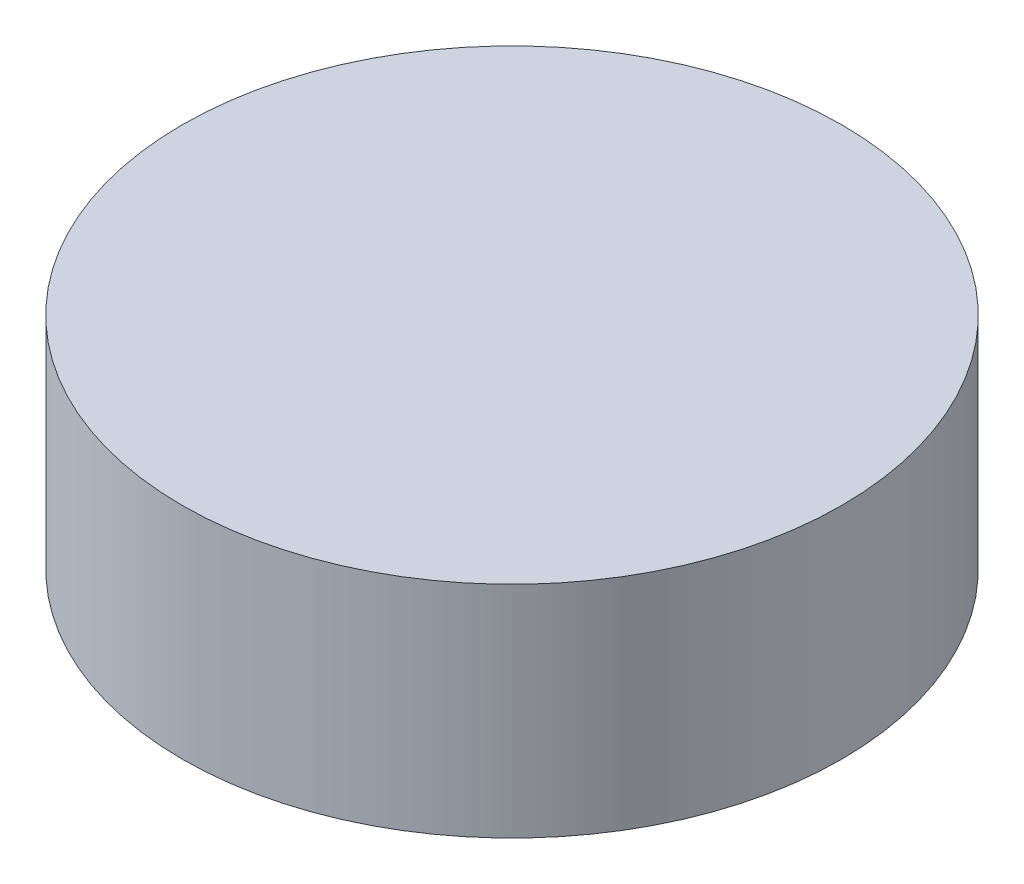
ISO-10303-21;
HEADER;
FILE_DESCRIPTION(('STEP AP214'),'2;1');
FILE_NAME('part.step','',(''),(''),'','','');
FILE_SCHEMA(('AUTOMOTIVE_DESIGN { 1 0 10303 214 1 1 1 1 }'));
ENDSEC;
DATA;
#1=APPLICATION_CONTEXT('core data for automotive mechanical design processes');
#2=APPLICATION_PROTOCOL_DEFINITION('international standard','automotive_design',2000,#1);
#3=PRODUCT_CONTEXT('',#1,'mechanical');
#4=PRODUCT('Part','Part','',(#3));
#5=PRODUCT_RELATED_PRODUCT_CATEGORY('part','',(#4));
#6=PRODUCT_DEFINITION_FORMATION('','',#4);
#7=PRODUCT_DEFINITION_CONTEXT('part definition',#1,'design');
#8=PRODUCT_DEFINITION('design','',#6,#7);
#9=PRODUCT_DEFINITION_SHAPE('','',#8);
#10=(LENGTH_UNIT() NAMED_UNIT(*) SI_UNIT(.MILLI.,.METRE.));
#11=(NAMED_UNIT(*) PLANE_ANGLE_UNIT() SI_UNIT($,.RADIAN.));
#12=(NAMED_UNIT(*) SI_UNIT($,.STERADIAN.) SOLID_ANGLE_UNIT());
#13=UNCERTAINTY_MEASURE_WITH_UNIT(LENGTH_MEASURE(1.E-05),#10,'distance_accuracy_value','');
#14=(GEOMETRIC_REPRESENTATION_CONTEXT(3) GLOBAL_UNCERTAINTY_ASSIGNED_CONTEXT((#13)) GLOBAL_UNIT_ASSIGNED_CONTEXT((#10,
#11,#12)) REPRESENTATION_CONTEXT('',''));
#15=CARTESIAN_POINT('',(0.,0.,0.));
#16=DIRECTION('',(0.,0.,1.));
#17=DIRECTION('',(1.,0.,0.));
#18=AXIS2_PLACEMENT_3D('',#15,#16,#17);
#19=CARTESIAN_POINT('',(0.,10.,0.));
#20=DIRECTION('',(0.,-1.,0.));
#21=DIRECTION('',(0.,0.,-1.));
#22=AXIS2_PLACEMENT_3D('',#19,#20,#21);
#23=CYLINDRICAL_SURFACE('',#22,15.);
#24=CARTESIAN_POINT('',(0.,10.,0.));
#25=DIRECTION('',(0.,1.,0.));
#26=DIRECTION('',(0.,0.,1.));
#27=AXIS2_PLACEMENT_3D('',#24,#25,#26);
#28=CIRCLE('',#27,15.);
#29=CARTESIAN_POINT('',(0.,10.,15.));
#30=VERTEX_POINT('',#29);
#31=EDGE_CURVE('E43',#30,#30,#28,.T.);
#32=ORIENTED_EDGE('',*,*,#31,.F.);
#33=EDGE_LOOP('',(#32));
#34=FACE_BOUND('',#33,.T.);
#35=CARTESIAN_POINT('',(0.,0.,0.));
#36=DIRECTION('',(0.,1.,0.));
#37=DIRECTION('',(0.,0.,1.));
#38=AXIS2_PLACEMENT_3D('',#35,#36,#37);
#39=CIRCLE('',#38,15.);
#40=CARTESIAN_POINT('',(0.,0.,15.));
#41=VERTEX_POINT('',#40);
#42=EDGE_CURVE('E38',#41,#41,#39,.T.);
#43=ORIENTED_EDGE('',*,*,#42,.T.);
#44=EDGE_LOOP('',(#43));
#45=FACE_BOUND('',#44,.T.);
#46=ADVANCED_FACE('F35',(#34,#45),#23,.T.);
#47=CARTESIAN_POINT('',(0.,10.,0.));
#48=DIRECTION('',(0.,1.,0.));
#49=DIRECTION('',(0.,0.,1.));
#50=AXIS2_PLACEMENT_3D('',#47,#48,#49);
#51=PLANE('',#50);
#52=ORIENTED_EDGE('',*,*,#31,.T.);
#53=EDGE_LOOP('',(#52));
#54=FACE_BOUND('',#53,.T.);
#55=ADVANCED_FACE('F63',(#54),#51,.T.);
#56=CARTESIAN_POINT('',(0.,0.,0.));
#57=DIRECTION('',(0.,1.,0.));
#58=DIRECTION('',(0.,0.,1.));
#59=AXIS2_PLACEMENT_3D('',#56,#57,#58);
#60=PLANE('',#59);
#61=CARTESIAN_POINT('',(0.,0.,0.));
#62=DIRECTION('',(0.,-1.,0.));
#63=DIRECTION('',(0.,0.,-1.));
#64=AXIS2_PLACEMENT_3D('',#61,#62,#63);
#65=CIRCLE('',#64,4.5);
#66=CARTESIAN_POINT('',(0.,0.,-4.5));
#67=VERTEX_POINT('',#66);
#68=EDGE_CURVE('E10',#67,#67,#65,.T.);
#69=ORIENTED_EDGE('',*,*,#68,.F.);
#70=EDGE_LOOP('',(#69));
#71=FACE_BOUND('',#70,.T.);
#72=ORIENTED_EDGE('',*,*,#42,.F.);
#73=EDGE_LOOP('',(#72));
#74=FACE_BOUND('',#73,.T.);
#75=ADVANCED_FACE('F60',(#71,#74),#60,.F.);
#76=CARTESIAN_POINT('',(0.,-3.,0.));
#77=DIRECTION('',(0.,1.,0.));
#78=DIRECTION('',(0.,0.,1.));
#79=AXIS2_PLACEMENT_3D('',#76,#77,#78);
#80=CYLINDRICAL_SURFACE('',#79,4.5);
#81=CARTESIAN_POINT('',(0.,-3.,0.));
#82=DIRECTION('',(0.,-1.,0.));
#83=DIRECTION('',(0.,0.,-1.));
#84=AXIS2_PLACEMENT_3D('',#81,#82,#83);
#85=CIRCLE('',#84,4.5);
#86=CARTESIAN_POINT('',(0.,-3.,-4.5));
#87=VERTEX_POINT('',#86);
#88=EDGE_CURVE('E50',#87,#87,#85,.T.);
#89=ORIENTED_EDGE('',*,*,#88,.F.);
#90=EDGE_LOOP('',(#89));
#91=FACE_BOUND('',#90,.T.);
#92=ORIENTED_EDGE('',*,*,#68,.T.);
#93=EDGE_LOOP('',(#92));
#94=FACE_BOUND('',#93,.T.);
#95=ADVANCED_FACE('F62',(#91,#94),#80,.T.);
#96=CARTESIAN_POINT('',(0.,-3.,0.));
#97=DIRECTION('',(0.,-1.,0.));
#98=DIRECTION('',(0.,0.,-1.));
#99=AXIS2_PLACEMENT_3D('',#96,#97,#98);
#100=PLANE('',#99);
#101=ORIENTED_EDGE('',*,*,#88,.T.);
#102=EDGE_LOOP('',(#101));
#103=FACE_BOUND('',#102,.T.);
#104=ADVANCED_FACE('F69',(#103),#100,.T.);
#105=CLOSED_SHELL('',(#46,#55,#75,#95,#104));
#106=MANIFOLD_SOLID_BREP('B2',#105);
#107=ADVANCED_BREP_SHAPE_REPRESENTATION('',(#18,#106),#14);
#108=SHAPE_DEFINITION_REPRESENTATION(#9,#107);
ENDSEC;
END-ISO-10303-21;
